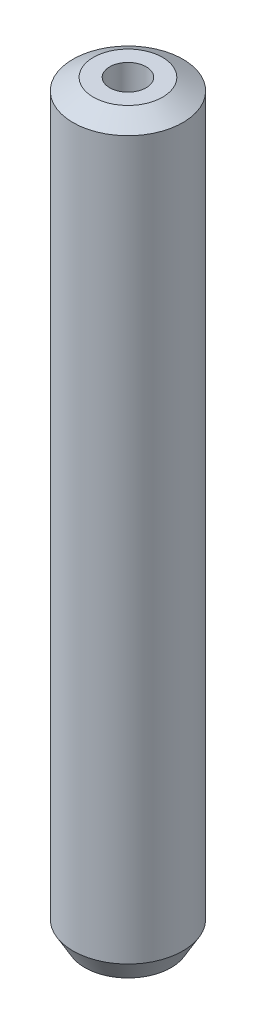
ISO-10303-21;
HEADER;
FILE_DESCRIPTION(('STEP AP214'),'2;1');
FILE_NAME('part.step','',(''),(''),'','','');
FILE_SCHEMA(('AUTOMOTIVE_DESIGN { 1 0 10303 214 1 1 1 1 }'));
ENDSEC;
DATA;
#1=APPLICATION_CONTEXT('core data for automotive mechanical design processes');
#2=APPLICATION_PROTOCOL_DEFINITION('international standard','automotive_design',2000,#1);
#3=PRODUCT_CONTEXT('',#1,'mechanical');
#4=PRODUCT('Part','Part','',(#3));
#5=PRODUCT_RELATED_PRODUCT_CATEGORY('part','',(#4));
#6=PRODUCT_DEFINITION_FORMATION('','',#4);
#7=PRODUCT_DEFINITION_CONTEXT('part definition',#1,'design');
#8=PRODUCT_DEFINITION('design','',#6,#7);
#9=PRODUCT_DEFINITION_SHAPE('','',#8);
#10=(LENGTH_UNIT() NAMED_UNIT(*) SI_UNIT(.MILLI.,.METRE.));
#11=(NAMED_UNIT(*) PLANE_ANGLE_UNIT() SI_UNIT($,.RADIAN.));
#12=(NAMED_UNIT(*) SI_UNIT($,.STERADIAN.) SOLID_ANGLE_UNIT());
#13=UNCERTAINTY_MEASURE_WITH_UNIT(LENGTH_MEASURE(1.E-05),#10,'distance_accuracy_value','');
#14=(GEOMETRIC_REPRESENTATION_CONTEXT(3) GLOBAL_UNCERTAINTY_ASSIGNED_CONTEXT((#13)) GLOBAL_UNIT_ASSIGNED_CONTEXT((#10,
#11,#12)) REPRESENTATION_CONTEXT('',''));
#15=CARTESIAN_POINT('',(0.,0.,0.));
#16=DIRECTION('',(0.,0.,1.));
#17=DIRECTION('',(1.,0.,0.));
#18=AXIS2_PLACEMENT_3D('',#15,#16,#17);
#19=CARTESIAN_POINT('',(0.,204.605867922332,0.));
#20=DIRECTION('',(0.,-1.,0.));
#21=DIRECTION('',(0.,0.,-1.));
#22=AXIS2_PLACEMENT_3D('',#19,#20,#21);
#23=CYLINDRICAL_SURFACE('',#22,15.);
#24=CARTESIAN_POINT('',(0.,201.391982613942,0.));
#25=DIRECTION('',(0.,1.,0.));
#26=DIRECTION('',(0.,0.,1.));
#27=AXIS2_PLACEMENT_3D('',#24,#25,#26);
#28=CIRCLE('',#27,15.);
#29=CARTESIAN_POINT('',(0.,201.391982613942,15.));
#30=VERTEX_POINT('',#29);
#31=EDGE_CURVE('E50',#30,#30,#28,.F.);
#32=ORIENTED_EDGE('',*,*,#31,.T.);
#33=EDGE_LOOP('',(#32));
#34=FACE_BOUND('',#33,.T.);
#35=CARTESIAN_POINT('',(0.,5.56661264383021,0.));
#36=DIRECTION('',(0.,1.,0.));
#37=DIRECTION('',(0.,0.,1.));
#38=AXIS2_PLACEMENT_3D('',#35,#36,#37);
#39=CIRCLE('',#38,15.);
#40=CARTESIAN_POINT('',(0.,5.56661264383021,15.));
#41=VERTEX_POINT('',#40);
#42=EDGE_CURVE('E51',#41,#41,#39,.T.);
#43=ORIENTED_EDGE('',*,*,#42,.T.);
#44=EDGE_LOOP('',(#43));
#45=FACE_BOUND('',#44,.T.);
#46=ADVANCED_FACE('F39',(#34,#45),#23,.T.);
#47=CARTESIAN_POINT('',(0.,204.605867922332,0.));
#48=DIRECTION('',(0.,1.,0.));
#49=DIRECTION('',(0.,0.,1.));
#50=AXIS2_PLACEMENT_3D('',#47,#48,#49);
#51=PLANE('',#50);
#52=CARTESIAN_POINT('',(0.,204.605867922332,0.));
#53=DIRECTION('',(0.,1.,0.));
#54=DIRECTION('',(0.,0.,1.));
#55=AXIS2_PLACEMENT_3D('',#52,#53,#54);
#56=CIRCLE('',#55,9.4333873561698);
#57=CARTESIAN_POINT('',(0.,204.605867922332,9.4333873561698));
#58=VERTEX_POINT('',#57);
#59=EDGE_CURVE('E54',#58,#58,#56,.T.);
#60=ORIENTED_EDGE('',*,*,#59,.T.);
#61=EDGE_LOOP('',(#60));
#62=FACE_BOUND('',#61,.T.);
#63=CARTESIAN_POINT('',(0.,204.605867922332,0.));
#64=DIRECTION('',(0.,1.,0.));
#65=DIRECTION('',(0.,0.,1.));
#66=AXIS2_PLACEMENT_3D('',#63,#64,#65);
#67=CIRCLE('',#66,4.9778040440337);
#68=CARTESIAN_POINT('',(0.,204.605867922332,4.9778040440337));
#69=VERTEX_POINT('',#68);
#70=EDGE_CURVE('E58',#69,#69,#67,.T.);
#71=ORIENTED_EDGE('',*,*,#70,.F.);
#72=EDGE_LOOP('',(#71));
#73=FACE_BOUND('',#72,.T.);
#74=ADVANCED_FACE('F69',(#62,#73),#51,.T.);
#75=CARTESIAN_POINT('',(0.,0.,0.));
#76=DIRECTION('',(0.,1.,0.));
#77=DIRECTION('',(0.,0.,1.));
#78=AXIS2_PLACEMENT_3D('',#75,#76,#77);
#79=PLANE('',#78);
#80=CARTESIAN_POINT('',(0.,0.,0.));
#81=DIRECTION('',(0.,1.,0.));
#82=DIRECTION('',(0.,0.,1.));
#83=AXIS2_PLACEMENT_3D('',#80,#81,#82);
#84=CIRCLE('',#83,11.7861146916102);
#85=CARTESIAN_POINT('',(0.,0.,11.7861146916102));
#86=VERTEX_POINT('',#85);
#87=EDGE_CURVE('E10',#86,#86,#84,.F.);
#88=ORIENTED_EDGE('',*,*,#87,.T.);
#89=EDGE_LOOP('',(#88));
#90=FACE_BOUND('',#89,.T.);
#91=CARTESIAN_POINT('',(0.,0.,0.));
#92=DIRECTION('',(0.,1.,0.));
#93=DIRECTION('',(0.,0.,1.));
#94=AXIS2_PLACEMENT_3D('',#91,#92,#93);
#95=CIRCLE('',#94,4.9778040440337);
#96=CARTESIAN_POINT('',(0.,0.,4.9778040440337));
#97=VERTEX_POINT('',#96);
#98=EDGE_CURVE('E63',#97,#97,#95,.T.);
#99=ORIENTED_EDGE('',*,*,#98,.T.);
#100=EDGE_LOOP('',(#99));
#101=FACE_BOUND('',#100,.T.);
#102=ADVANCED_FACE('F75',(#90,#101),#79,.F.);
#103=CARTESIAN_POINT('',(0.,204.605867922332,0.));
#104=DIRECTION('',(0.,-1.,0.));
#105=DIRECTION('',(0.,0.,-1.));
#106=AXIS2_PLACEMENT_3D('',#103,#104,#105);
#107=CYLINDRICAL_SURFACE('',#106,4.9778040440337);
#108=ORIENTED_EDGE('',*,*,#70,.T.);
#109=EDGE_LOOP('',(#108));
#110=FACE_BOUND('',#109,.T.);
#111=ORIENTED_EDGE('',*,*,#98,.F.);
#112=EDGE_LOOP('',(#111));
#113=FACE_BOUND('',#112,.T.);
#114=ADVANCED_FACE('F70',(#110,#113),#107,.F.);
#115=CARTESIAN_POINT('',(0.,204.605867922332,0.));
#116=DIRECTION('',(0.,-1.,0.));
#117=DIRECTION('',(0.,0.,-1.));
#118=AXIS2_PLACEMENT_3D('',#115,#116,#117);
#119=CONICAL_SURFACE('',#118,9.4333873561698,1.04719755119659);
#120=ORIENTED_EDGE('',*,*,#31,.F.);
#121=EDGE_LOOP('',(#120));
#122=FACE_BOUND('',#121,.T.);
#123=ORIENTED_EDGE('',*,*,#59,.F.);
#124=EDGE_LOOP('',(#123));
#125=FACE_BOUND('',#124,.T.);
#126=ADVANCED_FACE('F81',(#122,#125),#119,.T.);
#127=CARTESIAN_POINT('',(0.,5.56661264383021,0.));
#128=DIRECTION('',(0.,1.,0.));
#129=DIRECTION('',(0.,0.,1.));
#130=AXIS2_PLACEMENT_3D('',#127,#128,#129);
#131=CONICAL_SURFACE('',#130,15.,0.523598775598302);
#132=ORIENTED_EDGE('',*,*,#87,.F.);
#133=EDGE_LOOP('',(#132));
#134=FACE_BOUND('',#133,.T.);
#135=ORIENTED_EDGE('',*,*,#42,.F.);
#136=EDGE_LOOP('',(#135));
#137=FACE_BOUND('',#136,.T.);
#138=ADVANCED_FACE('F45',(#134,#137),#131,.T.);
#139=CLOSED_SHELL('',(#46,#74,#102,#114,#126,#138));
#140=MANIFOLD_SOLID_BREP('B2',#139);
#141=ADVANCED_BREP_SHAPE_REPRESENTATION('',(#18,#140),#14);
#142=SHAPE_DEFINITION_REPRESENTATION(#9,#141);
ENDSEC;
END-ISO-10303-21;
